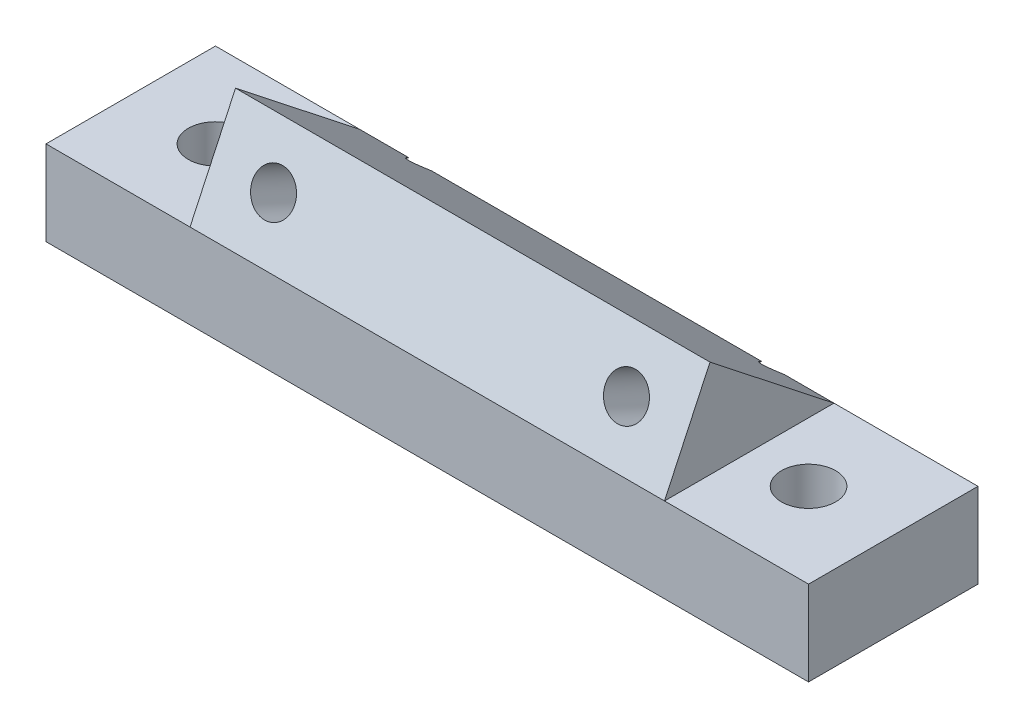
ISO-10303-21;
HEADER;
FILE_DESCRIPTION(('STEP AP214'),'2;1');
FILE_NAME('part.step','',(''),(''),'','','');
FILE_SCHEMA(('AUTOMOTIVE_DESIGN { 1 0 10303 214 1 1 1 1 }'));
ENDSEC;
DATA;
#1=APPLICATION_CONTEXT('core data for automotive mechanical design processes');
#2=APPLICATION_PROTOCOL_DEFINITION('international standard','automotive_design',2000,#1);
#3=PRODUCT_CONTEXT('',#1,'mechanical');
#4=PRODUCT('Part','Part','',(#3));
#5=PRODUCT_RELATED_PRODUCT_CATEGORY('part','',(#4));
#6=PRODUCT_DEFINITION_FORMATION('','',#4);
#7=PRODUCT_DEFINITION_CONTEXT('part definition',#1,'design');
#8=PRODUCT_DEFINITION('design','',#6,#7);
#9=PRODUCT_DEFINITION_SHAPE('','',#8);
#10=(LENGTH_UNIT() NAMED_UNIT(*) SI_UNIT(.MILLI.,.METRE.));
#11=(NAMED_UNIT(*) PLANE_ANGLE_UNIT() SI_UNIT($,.RADIAN.));
#12=(NAMED_UNIT(*) SI_UNIT($,.STERADIAN.) SOLID_ANGLE_UNIT());
#13=UNCERTAINTY_MEASURE_WITH_UNIT(LENGTH_MEASURE(1.E-05),#10,'distance_accuracy_value','');
#14=(GEOMETRIC_REPRESENTATION_CONTEXT(3) GLOBAL_UNCERTAINTY_ASSIGNED_CONTEXT((#13)) GLOBAL_UNIT_ASSIGNED_CONTEXT((#10,
#11,#12)) REPRESENTATION_CONTEXT('',''));
#15=CARTESIAN_POINT('',(0.,0.,0.));
#16=DIRECTION('',(0.,0.,1.));
#17=DIRECTION('',(1.,0.,0.));
#18=AXIS2_PLACEMENT_3D('',#15,#16,#17);
#19=CARTESIAN_POINT('',(0.,5.,0.));
#20=DIRECTION('',(0.,1.,0.));
#21=DIRECTION('',(0.,0.,1.));
#22=AXIS2_PLACEMENT_3D('',#19,#20,#21);
#23=PLANE('',#22);
#24=CARTESIAN_POINT('',(-17.5,5.,0.));
#25=DIRECTION('',(0.,1.,0.));
#26=DIRECTION('',(0.,0.,1.));
#27=AXIS2_PLACEMENT_3D('',#24,#25,#26);
#28=CIRCLE('',#27,1.6);
#29=CARTESIAN_POINT('',(-17.5,5.,1.6));
#30=VERTEX_POINT('',#29);
#31=EDGE_CURVE('E205',#30,#30,#28,.T.);
#32=ORIENTED_EDGE('',*,*,#31,.F.);
#33=EDGE_LOOP('',(#32));
#34=FACE_BOUND('',#33,.T.);
#35=DIRECTION('',(1.,0.,0.));
#36=VECTOR('',#35,1.);
#37=CARTESIAN_POINT('',(-22.5,5.,5.));
#38=LINE('',#37,#36);
#39=CARTESIAN_POINT('',(-22.5,5.,5.));
#40=VERTEX_POINT('',#39);
#41=CARTESIAN_POINT('',(-14.,5.,5.));
#42=VERTEX_POINT('',#41);
#43=EDGE_CURVE('E170',#40,#42,#38,.T.);
#44=ORIENTED_EDGE('',*,*,#43,.T.);
#45=DIRECTION('',(0.,0.,-1.));
#46=VECTOR('',#45,1.);
#47=CARTESIAN_POINT('',(-14.,5.,5.));
#48=LINE('',#47,#46);
#49=CARTESIAN_POINT('',(-14.,5.,-5.));
#50=VERTEX_POINT('',#49);
#51=EDGE_CURVE('E224',#42,#50,#48,.T.);
#52=ORIENTED_EDGE('',*,*,#51,.T.);
#53=DIRECTION('',(-1.,0.,0.));
#54=VECTOR('',#53,1.);
#55=CARTESIAN_POINT('',(-22.5,5.,-5.));
#56=LINE('',#55,#54);
#57=CARTESIAN_POINT('',(-22.5,5.,-5.));
#58=VERTEX_POINT('',#57);
#59=EDGE_CURVE('E155',#50,#58,#56,.T.);
#60=ORIENTED_EDGE('',*,*,#59,.T.);
#61=DIRECTION('',(0.,0.,1.));
#62=VECTOR('',#61,1.);
#63=CARTESIAN_POINT('',(-22.5,5.,-5.));
#64=LINE('',#63,#62);
#65=EDGE_CURVE('E154',#58,#40,#64,.T.);
#66=ORIENTED_EDGE('',*,*,#65,.T.);
#67=EDGE_LOOP('',(#44,#52,#60,#66));
#68=FACE_BOUND('',#67,.T.);
#69=ADVANCED_FACE('F33',(#34,#68),#23,.T.);
#70=DIRECTION('',(0.,0.,-1.));
#71=VECTOR('',#70,1.);
#72=CARTESIAN_POINT('',(14.,5.,5.));
#73=LINE('',#72,#71);
#74=CARTESIAN_POINT('',(14.,5.,5.));
#75=VERTEX_POINT('',#74);
#76=CARTESIAN_POINT('',(14.,5.,-5.));
#77=VERTEX_POINT('',#76);
#78=EDGE_CURVE('E125',#75,#77,#73,.T.);
#79=ORIENTED_EDGE('',*,*,#78,.F.);
#80=CARTESIAN_POINT('',(22.5,5.,5.));
#81=VERTEX_POINT('',#80);
#82=EDGE_CURVE('E164',#75,#81,#38,.T.);
#83=ORIENTED_EDGE('',*,*,#82,.T.);
#84=DIRECTION('',(0.,0.,-1.));
#85=VECTOR('',#84,1.);
#86=CARTESIAN_POINT('',(22.5,5.,-5.));
#87=LINE('',#86,#85);
#88=CARTESIAN_POINT('',(22.5,5.,-5.));
#89=VERTEX_POINT('',#88);
#90=EDGE_CURVE('E160',#81,#89,#87,.T.);
#91=ORIENTED_EDGE('',*,*,#90,.T.);
#92=EDGE_CURVE('E151',#89,#77,#56,.T.);
#93=ORIENTED_EDGE('',*,*,#92,.T.);
#94=EDGE_LOOP('',(#79,#83,#91,#93));
#95=FACE_BOUND('',#94,.T.);
#96=CARTESIAN_POINT('',(17.5,5.,0.));
#97=DIRECTION('',(0.,1.,0.));
#98=DIRECTION('',(0.,0.,-1.));
#99=AXIS2_PLACEMENT_3D('',#96,#97,#98);
#100=CIRCLE('',#99,1.6);
#101=CARTESIAN_POINT('',(17.5,5.,-1.6));
#102=VERTEX_POINT('',#101);
#103=EDGE_CURVE('E212',#102,#102,#100,.T.);
#104=ORIENTED_EDGE('',*,*,#103,.F.);
#105=EDGE_LOOP('',(#104));
#106=FACE_BOUND('',#105,.T.);
#107=ADVANCED_FACE('F183',(#95,#106),#23,.T.);
#108=CARTESIAN_POINT('',(0.,0.,0.));
#109=DIRECTION('',(0.,1.,0.));
#110=DIRECTION('',(0.,0.,1.));
#111=AXIS2_PLACEMENT_3D('',#108,#109,#110);
#112=PLANE('',#111);
#113=DIRECTION('',(0.,0.,-1.));
#114=VECTOR('',#113,1.);
#115=CARTESIAN_POINT('',(22.5,0.,-5.));
#116=LINE('',#115,#114);
#117=CARTESIAN_POINT('',(22.5,0.,5.));
#118=VERTEX_POINT('',#117);
#119=CARTESIAN_POINT('',(22.5,0.,-5.));
#120=VERTEX_POINT('',#119);
#121=EDGE_CURVE('E167',#118,#120,#116,.T.);
#122=ORIENTED_EDGE('',*,*,#121,.F.);
#123=DIRECTION('',(1.,0.,0.));
#124=VECTOR('',#123,1.);
#125=CARTESIAN_POINT('',(-22.5,0.,5.));
#126=LINE('',#125,#124);
#127=CARTESIAN_POINT('',(-22.5,0.,5.));
#128=VERTEX_POINT('',#127);
#129=EDGE_CURVE('E191',#128,#118,#126,.T.);
#130=ORIENTED_EDGE('',*,*,#129,.F.);
#131=DIRECTION('',(0.,0.,1.));
#132=VECTOR('',#131,1.);
#133=CARTESIAN_POINT('',(-22.5,0.,-5.));
#134=LINE('',#133,#132);
#135=CARTESIAN_POINT('',(-22.5,0.,-5.));
#136=VERTEX_POINT('',#135);
#137=EDGE_CURVE('E194',#136,#128,#134,.T.);
#138=ORIENTED_EDGE('',*,*,#137,.F.);
#139=DIRECTION('',(-1.,0.,0.));
#140=VECTOR('',#139,1.);
#141=CARTESIAN_POINT('',(-22.5,0.,-5.));
#142=LINE('',#141,#140);
#143=EDGE_CURVE('E196',#120,#136,#142,.T.);
#144=ORIENTED_EDGE('',*,*,#143,.F.);
#145=EDGE_LOOP('',(#122,#130,#138,#144));
#146=FACE_BOUND('',#145,.T.);
#147=CARTESIAN_POINT('',(-17.5,0.,0.));
#148=DIRECTION('',(0.,1.,0.));
#149=DIRECTION('',(0.,0.,1.));
#150=AXIS2_PLACEMENT_3D('',#147,#148,#149);
#151=CIRCLE('',#150,1.6);
#152=CARTESIAN_POINT('',(-17.5,0.,1.6));
#153=VERTEX_POINT('',#152);
#154=EDGE_CURVE('E207',#153,#153,#151,.T.);
#155=ORIENTED_EDGE('',*,*,#154,.T.);
#156=EDGE_LOOP('',(#155));
#157=FACE_BOUND('',#156,.T.);
#158=CARTESIAN_POINT('',(17.5,0.,0.));
#159=DIRECTION('',(0.,1.,0.));
#160=DIRECTION('',(0.,0.,-1.));
#161=AXIS2_PLACEMENT_3D('',#158,#159,#160);
#162=CIRCLE('',#161,1.6);
#163=CARTESIAN_POINT('',(17.5,0.,-1.6));
#164=VERTEX_POINT('',#163);
#165=EDGE_CURVE('E120',#164,#164,#162,.T.);
#166=ORIENTED_EDGE('',*,*,#165,.T.);
#167=EDGE_LOOP('',(#166));
#168=FACE_BOUND('',#167,.T.);
#169=ADVANCED_FACE('F203',(#146,#157,#168),#112,.F.);
#170=CARTESIAN_POINT('',(22.5,5.,-5.));
#171=DIRECTION('',(-1.,0.,0.));
#172=DIRECTION('',(0.,0.,1.));
#173=AXIS2_PLACEMENT_3D('',#170,#171,#172);
#174=PLANE('',#173);
#175=ORIENTED_EDGE('',*,*,#121,.T.);
#176=DIRECTION('',(0.,-1.,0.));
#177=VECTOR('',#176,1.);
#178=CARTESIAN_POINT('',(22.5,5.,-5.));
#179=LINE('',#178,#177);
#180=EDGE_CURVE('E139',#89,#120,#179,.T.);
#181=ORIENTED_EDGE('',*,*,#180,.F.);
#182=ORIENTED_EDGE('',*,*,#90,.F.);
#183=DIRECTION('',(0.,-1.,0.));
#184=VECTOR('',#183,1.);
#185=CARTESIAN_POINT('',(22.5,5.,5.));
#186=LINE('',#185,#184);
#187=EDGE_CURVE('E172',#81,#118,#186,.T.);
#188=ORIENTED_EDGE('',*,*,#187,.T.);
#189=EDGE_LOOP('',(#175,#181,#182,#188));
#190=FACE_BOUND('',#189,.T.);
#191=ADVANCED_FACE('F35',(#190),#174,.F.);
#192=CARTESIAN_POINT('',(-22.5,5.,-5.));
#193=DIRECTION('',(0.,0.,1.));
#194=DIRECTION('',(1.,0.,0.));
#195=AXIS2_PLACEMENT_3D('',#192,#193,#194);
#196=PLANE('',#195);
#197=DIRECTION('',(-1.,0.,0.));
#198=VECTOR('',#197,1.);
#199=CARTESIAN_POINT('',(14.,5.,-5.));
#200=LINE('',#199,#198);
#201=CARTESIAN_POINT('',(9.73760137133394,5.,-5.));
#202=VERTEX_POINT('',#201);
#203=CARTESIAN_POINT('',(-9.73760137133386,5.,-5.));
#204=VERTEX_POINT('',#203);
#205=EDGE_CURVE('E110',#202,#204,#200,.T.);
#206=ORIENTED_EDGE('',*,*,#205,.F.);
#207=CARTESIAN_POINT('',(10.414,3.84014831115589,-5.));
#208=DIRECTION('',(0.,0.,1.));
#209=DIRECTION('',(0.,1.,0.));
#210=AXIS2_PLACEMENT_3D('',#207,#208,#209);
#211=ELLIPSE('',#210,1.37922239870311,1.25);
#212=CARTESIAN_POINT('',(11.090398628666,5.,-5.));
#213=VERTEX_POINT('',#212);
#214=EDGE_CURVE('E47',#202,#213,#211,.T.);
#215=ORIENTED_EDGE('',*,*,#214,.T.);
#216=EDGE_CURVE('E108',#77,#213,#200,.T.);
#217=ORIENTED_EDGE('',*,*,#216,.F.);
#218=ORIENTED_EDGE('',*,*,#92,.F.);
#219=ORIENTED_EDGE('',*,*,#180,.T.);
#220=ORIENTED_EDGE('',*,*,#143,.T.);
#221=DIRECTION('',(0.,-1.,0.));
#222=VECTOR('',#221,1.);
#223=CARTESIAN_POINT('',(-22.5,5.,-5.));
#224=LINE('',#223,#222);
#225=EDGE_CURVE('E142',#58,#136,#224,.T.);
#226=ORIENTED_EDGE('',*,*,#225,.F.);
#227=ORIENTED_EDGE('',*,*,#59,.F.);
#228=CARTESIAN_POINT('',(-11.0903986286661,5.,-5.));
#229=VERTEX_POINT('',#228);
#230=EDGE_CURVE('E122',#229,#50,#200,.T.);
#231=ORIENTED_EDGE('',*,*,#230,.F.);
#232=CARTESIAN_POINT('',(-10.414,3.84014831115595,-5.));
#233=DIRECTION('',(0.,0.,1.));
#234=DIRECTION('',(0.,1.,0.));
#235=AXIS2_PLACEMENT_3D('',#232,#233,#234);
#236=ELLIPSE('',#235,1.37922239870311,1.25);
#237=EDGE_CURVE('E53',#229,#204,#236,.T.);
#238=ORIENTED_EDGE('',*,*,#237,.T.);
#239=EDGE_LOOP('',(#206,#215,#217,#218,#219,#220,#226,#227,#231,#238));
#240=FACE_BOUND('',#239,.T.);
#241=ADVANCED_FACE('F107',(#240),#196,.F.);
#242=CARTESIAN_POINT('',(-22.5,5.,-5.));
#243=DIRECTION('',(1.,0.,0.));
#244=DIRECTION('',(0.,0.,-1.));
#245=AXIS2_PLACEMENT_3D('',#242,#243,#244);
#246=PLANE('',#245);
#247=ORIENTED_EDGE('',*,*,#137,.T.);
#248=DIRECTION('',(0.,-1.,0.));
#249=VECTOR('',#248,1.);
#250=CARTESIAN_POINT('',(-22.5,5.,5.));
#251=LINE('',#250,#249);
#252=EDGE_CURVE('E147',#40,#128,#251,.T.);
#253=ORIENTED_EDGE('',*,*,#252,.F.);
#254=ORIENTED_EDGE('',*,*,#65,.F.);
#255=ORIENTED_EDGE('',*,*,#225,.T.);
#256=EDGE_LOOP('',(#247,#253,#254,#255));
#257=FACE_BOUND('',#256,.T.);
#258=ADVANCED_FACE('F250',(#257),#246,.F.);
#259=CARTESIAN_POINT('',(-22.5,5.,5.));
#260=DIRECTION('',(0.,0.,-1.));
#261=DIRECTION('',(-1.,0.,0.));
#262=AXIS2_PLACEMENT_3D('',#259,#260,#261);
#263=PLANE('',#262);
#264=ORIENTED_EDGE('',*,*,#129,.T.);
#265=ORIENTED_EDGE('',*,*,#187,.F.);
#266=ORIENTED_EDGE('',*,*,#82,.F.);
#267=DIRECTION('',(-1.,0.,0.));
#268=VECTOR('',#267,1.);
#269=CARTESIAN_POINT('',(14.,5.,5.));
#270=LINE('',#269,#268);
#271=EDGE_CURVE('E118',#75,#42,#270,.T.);
#272=ORIENTED_EDGE('',*,*,#271,.T.);
#273=ORIENTED_EDGE('',*,*,#43,.F.);
#274=ORIENTED_EDGE('',*,*,#252,.T.);
#275=EDGE_LOOP('',(#264,#265,#266,#272,#273,#274));
#276=FACE_BOUND('',#275,.T.);
#277=ADVANCED_FACE('F188',(#276),#263,.F.);
#278=CARTESIAN_POINT('',(-17.5,5.,0.));
#279=DIRECTION('',(0.,-1.,0.));
#280=DIRECTION('',(0.,0.,-1.));
#281=AXIS2_PLACEMENT_3D('',#278,#279,#280);
#282=CYLINDRICAL_SURFACE('',#281,1.6);
#283=ORIENTED_EDGE('',*,*,#31,.T.);
#284=EDGE_LOOP('',(#283));
#285=FACE_BOUND('',#284,.T.);
#286=ORIENTED_EDGE('',*,*,#154,.F.);
#287=EDGE_LOOP('',(#286));
#288=FACE_BOUND('',#287,.T.);
#289=ADVANCED_FACE('F257',(#285,#288),#282,.F.);
#290=CARTESIAN_POINT('',(17.5,5.,0.));
#291=DIRECTION('',(0.,-1.,0.));
#292=DIRECTION('',(0.,0.,-1.));
#293=AXIS2_PLACEMENT_3D('',#290,#291,#292);
#294=CYLINDRICAL_SURFACE('',#293,1.6);
#295=ORIENTED_EDGE('',*,*,#103,.T.);
#296=EDGE_LOOP('',(#295));
#297=FACE_BOUND('',#296,.T.);
#298=ORIENTED_EDGE('',*,*,#165,.F.);
#299=EDGE_LOOP('',(#298));
#300=FACE_BOUND('',#299,.T.);
#301=ADVANCED_FACE('F293',(#297,#300),#294,.F.);
#302=CARTESIAN_POINT('',(14.,5.,5.));
#303=DIRECTION('',(0.,-0.422618261740697,-0.906307787036651));
#304=DIRECTION('',(0.,0.906307787036651,-0.422618261740697));
#305=AXIS2_PLACEMENT_3D('',#302,#303,#304);
#306=PLANE('',#305);
#307=CARTESIAN_POINT('',(10.414,7.87752722384132,3.65818701897331));
#308=DIRECTION('',(0.,0.422618261740697,0.906307787036651));
#309=DIRECTION('',(0.,0.906307787036651,-0.422618261740697));
#310=AXIS2_PLACEMENT_3D('',#307,#308,#309);
#311=CIRCLE('',#310,1.25);
#312=CARTESIAN_POINT('',(10.414,9.01041195763713,3.12991419179744));
#313=VERTEX_POINT('',#312);
#314=EDGE_CURVE('E112',#313,#313,#311,.T.);
#315=ORIENTED_EDGE('',*,*,#314,.F.);
#316=EDGE_LOOP('',(#315));
#317=FACE_BOUND('',#316,.T.);
#318=CARTESIAN_POINT('',(-10.414,7.87752722384137,3.65818701897329));
#319=DIRECTION('',(0.,0.422618261740697,0.906307787036651));
#320=DIRECTION('',(0.,-0.906307787036651,0.422618261740697));
#321=AXIS2_PLACEMENT_3D('',#318,#319,#320);
#322=CIRCLE('',#321,1.25);
#323=CARTESIAN_POINT('',(-10.414,6.74464249004556,4.18645984614916));
#324=VERTEX_POINT('',#323);
#325=EDGE_CURVE('E111',#324,#324,#322,.T.);
#326=ORIENTED_EDGE('',*,*,#325,.F.);
#327=EDGE_LOOP('',(#326));
#328=FACE_BOUND('',#327,.T.);
#329=DIRECTION('',(0.,-0.906307787036651,0.422618261740697));
#330=VECTOR('',#329,1.);
#331=CARTESIAN_POINT('',(-14.,5.,5.));
#332=LINE('',#331,#330);
#333=CARTESIAN_POINT('',(-14.,10.7550544476827,2.31637403794657));
#334=VERTEX_POINT('',#333);
#335=EDGE_CURVE('E228',#334,#42,#332,.T.);
#336=ORIENTED_EDGE('',*,*,#335,.T.);
#337=ORIENTED_EDGE('',*,*,#271,.F.);
#338=DIRECTION('',(0.,-0.906307787036651,0.422618261740697));
#339=VECTOR('',#338,1.);
#340=CARTESIAN_POINT('',(14.,5.,5.));
#341=LINE('',#340,#339);
#342=CARTESIAN_POINT('',(14.,10.7550544476827,2.31637403794657));
#343=VERTEX_POINT('',#342);
#344=EDGE_CURVE('E233',#343,#75,#341,.T.);
#345=ORIENTED_EDGE('',*,*,#344,.F.);
#346=DIRECTION('',(-1.,0.,0.));
#347=VECTOR('',#346,1.);
#348=CARTESIAN_POINT('',(14.,10.7550544476827,2.31637403794657));
#349=LINE('',#348,#347);
#350=EDGE_CURVE('E136',#343,#334,#349,.T.);
#351=ORIENTED_EDGE('',*,*,#350,.T.);
#352=EDGE_LOOP('',(#336,#337,#345,#351));
#353=FACE_BOUND('',#352,.T.);
#354=ADVANCED_FACE('F245',(#317,#328,#353),#306,.F.);
#355=CARTESIAN_POINT('',(14.,10.7550544476827,2.31637403794657));
#356=DIRECTION('',(0.,-0.785980306811743,0.618251532391241));
#357=DIRECTION('',(0.,-0.618251532391241,-0.785980306811743));
#358=AXIS2_PLACEMENT_3D('',#355,#356,#357);
#359=PLANE('',#358);
#360=ORIENTED_EDGE('',*,*,#216,.T.);
#361=CARTESIAN_POINT('',(10.414,2.15153795838653,-8.621236587558));
#362=DIRECTION('',(0.,-0.785980306811743,0.618251532391241));
#363=DIRECTION('',(0.,0.618251532391241,0.785980306811743));
#364=AXIS2_PLACEMENT_3D('',#361,#362,#363);
#365=ELLIPSE('',#364,5.47869441286689,1.25);
#366=EDGE_CURVE('E11',#213,#202,#365,.T.);
#367=ORIENTED_EDGE('',*,*,#366,.T.);
#368=ORIENTED_EDGE('',*,*,#205,.T.);
#369=CARTESIAN_POINT('',(-10.414,2.15153795838669,-8.62123658755779));
#370=DIRECTION('',(0.,-0.785980306811743,0.618251532391241));
#371=DIRECTION('',(0.,0.618251532391241,0.785980306811743));
#372=AXIS2_PLACEMENT_3D('',#369,#370,#371);
#373=ELLIPSE('',#372,5.47869441286689,1.25);
#374=EDGE_CURVE('E41',#204,#229,#373,.T.);
#375=ORIENTED_EDGE('',*,*,#374,.T.);
#376=ORIENTED_EDGE('',*,*,#230,.T.);
#377=DIRECTION('',(0.,0.618251532391241,0.785980306811743));
#378=VECTOR('',#377,1.);
#379=CARTESIAN_POINT('',(-14.,10.7550544476827,2.31637403794657));
#380=LINE('',#379,#378);
#381=EDGE_CURVE('E227',#50,#334,#380,.T.);
#382=ORIENTED_EDGE('',*,*,#381,.T.);
#383=ORIENTED_EDGE('',*,*,#350,.F.);
#384=DIRECTION('',(0.,0.618251532391241,0.785980306811743));
#385=VECTOR('',#384,1.);
#386=CARTESIAN_POINT('',(14.,10.7550544476827,2.31637403794657));
#387=LINE('',#386,#385);
#388=EDGE_CURVE('E117',#77,#343,#387,.T.);
#389=ORIENTED_EDGE('',*,*,#388,.F.);
#390=EDGE_LOOP('',(#360,#367,#368,#375,#376,#382,#383,#389));
#391=FACE_BOUND('',#390,.T.);
#392=ADVANCED_FACE('F115',(#391),#359,.F.);
#393=CARTESIAN_POINT('',(14.,0.,0.));
#394=DIRECTION('',(-1.,0.,0.));
#395=DIRECTION('',(0.,0.,1.));
#396=AXIS2_PLACEMENT_3D('',#393,#394,#395);
#397=PLANE('',#396);
#398=ORIENTED_EDGE('',*,*,#344,.T.);
#399=ORIENTED_EDGE('',*,*,#78,.T.);
#400=ORIENTED_EDGE('',*,*,#388,.T.);
#401=EDGE_LOOP('',(#398,#399,#400));
#402=FACE_BOUND('',#401,.T.);
#403=ADVANCED_FACE('F242',(#402),#397,.F.);
#404=CARTESIAN_POINT('',(-14.,0.,0.));
#405=DIRECTION('',(-1.,0.,0.));
#406=DIRECTION('',(0.,0.,1.));
#407=AXIS2_PLACEMENT_3D('',#404,#405,#406);
#408=PLANE('',#407);
#409=ORIENTED_EDGE('',*,*,#335,.F.);
#410=ORIENTED_EDGE('',*,*,#381,.F.);
#411=ORIENTED_EDGE('',*,*,#51,.F.);
#412=EDGE_LOOP('',(#409,#410,#411));
#413=FACE_BOUND('',#412,.T.);
#414=ADVANCED_FACE('F247',(#413),#408,.T.);
#415=CARTESIAN_POINT('',(-10.414,-3.95578410489816,-21.7184310180529));
#416=DIRECTION('',(0.,0.422618261740697,0.906307787036651));
#417=DIRECTION('',(0.,-0.906307787036651,0.422618261740697));
#418=AXIS2_PLACEMENT_3D('',#415,#416,#417);
#419=CYLINDRICAL_SURFACE('',#418,1.25);
#420=ORIENTED_EDGE('',*,*,#325,.T.);
#421=EDGE_LOOP('',(#420));
#422=FACE_BOUND('',#421,.T.);
#423=ORIENTED_EDGE('',*,*,#374,.F.);
#424=ORIENTED_EDGE('',*,*,#237,.F.);
#425=EDGE_LOOP('',(#423,#424));
#426=FACE_BOUND('',#425,.T.);
#427=ADVANCED_FACE('F311',(#422,#426),#419,.F.);
#428=CARTESIAN_POINT('',(10.414,-3.95578410489821,-21.7184310180529));
#429=DIRECTION('',(0.,0.422618261740697,0.906307787036651));
#430=DIRECTION('',(0.,-0.906307787036651,0.422618261740697));
#431=AXIS2_PLACEMENT_3D('',#428,#429,#430);
#432=CYLINDRICAL_SURFACE('',#431,1.25);
#433=ORIENTED_EDGE('',*,*,#314,.T.);
#434=EDGE_LOOP('',(#433));
#435=FACE_BOUND('',#434,.T.);
#436=ORIENTED_EDGE('',*,*,#366,.F.);
#437=ORIENTED_EDGE('',*,*,#214,.F.);
#438=EDGE_LOOP('',(#436,#437));
#439=FACE_BOUND('',#438,.T.);
#440=ADVANCED_FACE('F101',(#435,#439),#432,.F.);
#441=CLOSED_SHELL('',(#69,#107,#169,#191,#241,#258,#277,#289,#301,#354,#392,#403,#414,#427,#440));
#442=MANIFOLD_SOLID_BREP('B2',#441);
#443=ADVANCED_BREP_SHAPE_REPRESENTATION('',(#18,#442),#14);
#444=SHAPE_DEFINITION_REPRESENTATION(#9,#443);
ENDSEC;
END-ISO-10303-21;
